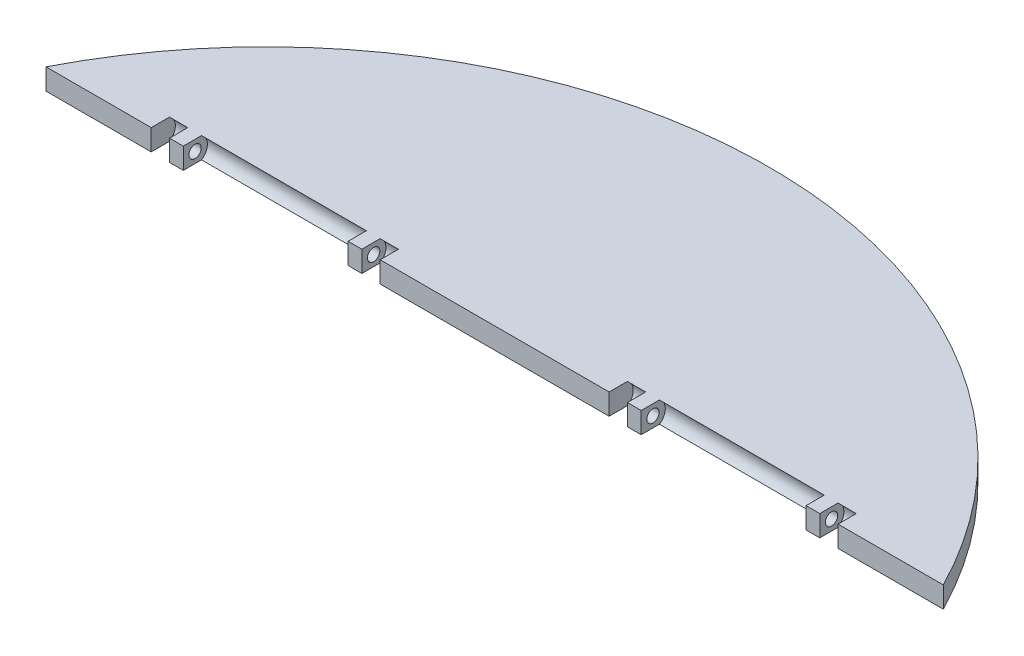
ISO-10303-21;
HEADER;
FILE_DESCRIPTION(('STEP AP214'),'2;1');
FILE_NAME('part.step','',(''),(''),'','','');
FILE_SCHEMA(('AUTOMOTIVE_DESIGN { 1 0 10303 214 1 1 1 1 }'));
ENDSEC;
DATA;
#1=APPLICATION_CONTEXT('core data for automotive mechanical design processes');
#2=APPLICATION_PROTOCOL_DEFINITION('international standard','automotive_design',2000,#1);
#3=PRODUCT_CONTEXT('',#1,'mechanical');
#4=PRODUCT('Part','Part','',(#3));
#5=PRODUCT_RELATED_PRODUCT_CATEGORY('part','',(#4));
#6=PRODUCT_DEFINITION_FORMATION('','',#4);
#7=PRODUCT_DEFINITION_CONTEXT('part definition',#1,'design');
#8=PRODUCT_DEFINITION('design','',#6,#7);
#9=PRODUCT_DEFINITION_SHAPE('','',#8);
#10=(LENGTH_UNIT() NAMED_UNIT(*) SI_UNIT(.MILLI.,.METRE.));
#11=(NAMED_UNIT(*) PLANE_ANGLE_UNIT() SI_UNIT($,.RADIAN.));
#12=(NAMED_UNIT(*) SI_UNIT($,.STERADIAN.) SOLID_ANGLE_UNIT());
#13=UNCERTAINTY_MEASURE_WITH_UNIT(LENGTH_MEASURE(1.E-05),#10,'distance_accuracy_value','');
#14=(GEOMETRIC_REPRESENTATION_CONTEXT(3) GLOBAL_UNCERTAINTY_ASSIGNED_CONTEXT((#13)) GLOBAL_UNIT_ASSIGNED_CONTEXT((#10,
#11,#12)) REPRESENTATION_CONTEXT('',''));
#15=CARTESIAN_POINT('',(0.,0.,0.));
#16=DIRECTION('',(0.,0.,1.));
#17=DIRECTION('',(1.,0.,0.));
#18=AXIS2_PLACEMENT_3D('',#15,#16,#17);
#19=CARTESIAN_POINT('',(-12.5,1.15,-26.2848125951927));
#20=DIRECTION('',(-1.,0.,0.));
#21=DIRECTION('',(0.,0.,1.));
#22=AXIS2_PLACEMENT_3D('',#19,#20,#21);
#23=CYLINDRICAL_SURFACE('',#22,1.35);
#24=DIRECTION('',(-1.,0.,0.));
#25=VECTOR('',#24,1.);
#26=CARTESIAN_POINT('',(-12.5,2.3,-26.9919193763793));
#27=LINE('',#26,#25);
#28=CARTESIAN_POINT('',(-12.5,2.3,-26.9919193763793));
#29=VERTEX_POINT('',#28);
#30=CARTESIAN_POINT('',(-14.5,2.3,-26.9919193763793));
#31=VERTEX_POINT('',#30);
#32=EDGE_CURVE('E372',#29,#31,#27,.T.);
#33=ORIENTED_EDGE('',*,*,#32,.T.);
#34=CARTESIAN_POINT('',(-14.5,1.15,-26.2848125951927));
#35=DIRECTION('',(1.,0.,0.));
#36=DIRECTION('',(0.,0.,-1.));
#37=AXIS2_PLACEMENT_3D('',#34,#35,#36);
#38=CIRCLE('',#37,1.35);
#39=CARTESIAN_POINT('',(-14.5,0.,-26.9919193763793));
#40=VERTEX_POINT('',#39);
#41=EDGE_CURVE('E285',#40,#31,#38,.T.);
#42=ORIENTED_EDGE('',*,*,#41,.F.);
#43=DIRECTION('',(-1.,0.,0.));
#44=VECTOR('',#43,1.);
#45=CARTESIAN_POINT('',(-12.5,0.,-26.9919193763793));
#46=LINE('',#45,#44);
#47=CARTESIAN_POINT('',(-12.5,0.,-26.9919193763793));
#48=VERTEX_POINT('',#47);
#49=EDGE_CURVE('E366',#48,#40,#46,.T.);
#50=ORIENTED_EDGE('',*,*,#49,.F.);
#51=CARTESIAN_POINT('',(-12.5,1.15,-26.2848125951927));
#52=DIRECTION('',(1.,0.,0.));
#53=DIRECTION('',(0.,0.,-1.));
#54=AXIS2_PLACEMENT_3D('',#51,#52,#53);
#55=CIRCLE('',#54,1.35);
#56=EDGE_CURVE('E354',#48,#29,#55,.T.);
#57=ORIENTED_EDGE('',*,*,#56,.T.);
#58=EDGE_LOOP('',(#33,#42,#50,#57));
#59=FACE_BOUND('',#58,.T.);
#60=ADVANCED_FACE('F41',(#59),#23,.F.);
#61=CARTESIAN_POINT('',(-16.,1.15,-26.2848125951927));
#62=DIRECTION('',(1.,0.,0.));
#63=DIRECTION('',(0.,0.,-1.));
#64=AXIS2_PLACEMENT_3D('',#61,#62,#63);
#65=CIRCLE('',#64,1.35);
#66=CARTESIAN_POINT('',(-16.,0.,-26.9919193763793));
#67=VERTEX_POINT('',#66);
#68=CARTESIAN_POINT('',(-16.,2.3,-26.9919193763793));
#69=VERTEX_POINT('',#68);
#70=EDGE_CURVE('E293',#67,#69,#65,.T.);
#71=ORIENTED_EDGE('',*,*,#70,.T.);
#72=CARTESIAN_POINT('',(-34.,2.3,-26.9919193763793));
#73=VERTEX_POINT('',#72);
#74=EDGE_CURVE('E375',#69,#73,#27,.T.);
#75=ORIENTED_EDGE('',*,*,#74,.T.);
#76=CARTESIAN_POINT('',(-34.,1.15,-26.2848125951927));
#77=DIRECTION('',(1.,0.,0.));
#78=DIRECTION('',(0.,0.,-1.));
#79=AXIS2_PLACEMENT_3D('',#76,#77,#78);
#80=CIRCLE('',#79,1.35);
#81=CARTESIAN_POINT('',(-34.,0.,-26.9919193763793));
#82=VERTEX_POINT('',#81);
#83=EDGE_CURVE('E316',#82,#73,#80,.T.);
#84=ORIENTED_EDGE('',*,*,#83,.F.);
#85=EDGE_CURVE('E370',#67,#82,#46,.T.);
#86=ORIENTED_EDGE('',*,*,#85,.F.);
#87=EDGE_LOOP('',(#71,#75,#84,#86));
#88=FACE_BOUND('',#87,.T.);
#89=ADVANCED_FACE('F553',(#88),#23,.F.);
#90=CARTESIAN_POINT('',(0.,2.3,-25.));
#91=DIRECTION('',(0.,0.,-1.));
#92=DIRECTION('',(-1.,0.,0.));
#93=AXIS2_PLACEMENT_3D('',#90,#91,#92);
#94=PLANE('',#93);
#95=DIRECTION('',(0.,-1.,0.));
#96=VECTOR('',#95,1.);
#97=CARTESIAN_POINT('',(-12.5,0.,-25.));
#98=LINE('',#97,#96);
#99=CARTESIAN_POINT('',(-12.5,2.3,-25.));
#100=VERTEX_POINT('',#99);
#101=CARTESIAN_POINT('',(-12.5,0.,-25.));
#102=VERTEX_POINT('',#101);
#103=EDGE_CURVE('E347',#100,#102,#98,.T.);
#104=ORIENTED_EDGE('',*,*,#103,.T.);
#105=DIRECTION('',(1.,0.,0.));
#106=VECTOR('',#105,1.);
#107=CARTESIAN_POINT('',(0.,0.,-25.));
#108=LINE('',#107,#106);
#109=CARTESIAN_POINT('',(12.5,0.,-25.));
#110=VERTEX_POINT('',#109);
#111=EDGE_CURVE('E485',#102,#110,#108,.T.);
#112=ORIENTED_EDGE('',*,*,#111,.T.);
#113=DIRECTION('',(0.,-1.,0.));
#114=VECTOR('',#113,1.);
#115=CARTESIAN_POINT('',(12.5,0.,-25.));
#116=LINE('',#115,#114);
#117=CARTESIAN_POINT('',(12.5,2.3,-25.));
#118=VERTEX_POINT('',#117);
#119=EDGE_CURVE('E451',#118,#110,#116,.T.);
#120=ORIENTED_EDGE('',*,*,#119,.F.);
#121=DIRECTION('',(1.,0.,0.));
#122=VECTOR('',#121,1.);
#123=CARTESIAN_POINT('',(0.,2.3,-25.));
#124=LINE('',#123,#122);
#125=EDGE_CURVE('E478',#100,#118,#124,.T.);
#126=ORIENTED_EDGE('',*,*,#125,.F.);
#127=EDGE_LOOP('',(#104,#112,#120,#126));
#128=FACE_BOUND('',#127,.T.);
#129=ADVANCED_FACE('F516',(#128),#94,.F.);
#130=CARTESIAN_POINT('',(0.,2.3,0.));
#131=DIRECTION('',(0.,1.,0.));
#132=DIRECTION('',(0.,0.,1.));
#133=AXIS2_PLACEMENT_3D('',#130,#131,#132);
#134=PLANE('',#133);
#135=ORIENTED_EDGE('',*,*,#32,.F.);
#136=DIRECTION('',(0.,0.,-1.));
#137=VECTOR('',#136,1.);
#138=CARTESIAN_POINT('',(-12.5,2.3,0.));
#139=LINE('',#138,#137);
#140=EDGE_CURVE('E351',#100,#29,#139,.T.);
#141=ORIENTED_EDGE('',*,*,#140,.F.);
#142=ORIENTED_EDGE('',*,*,#125,.T.);
#143=DIRECTION('',(0.,0.,-1.));
#144=VECTOR('',#143,1.);
#145=CARTESIAN_POINT('',(12.5,2.3,0.));
#146=LINE('',#145,#144);
#147=CARTESIAN_POINT('',(12.5,2.3,-26.9919193763793));
#148=VERTEX_POINT('',#147);
#149=EDGE_CURVE('E448',#118,#148,#146,.T.);
#150=ORIENTED_EDGE('',*,*,#149,.T.);
#151=DIRECTION('',(1.,0.,0.));
#152=VECTOR('',#151,1.);
#153=CARTESIAN_POINT('',(12.5,2.3,-26.9919193763793));
#154=LINE('',#153,#152);
#155=CARTESIAN_POINT('',(14.5,2.3,-26.9919193763793));
#156=VERTEX_POINT('',#155);
#157=EDGE_CURVE('E465',#148,#156,#154,.T.);
#158=ORIENTED_EDGE('',*,*,#157,.T.);
#159=DIRECTION('',(0.,0.,-1.));
#160=VECTOR('',#159,1.);
#161=CARTESIAN_POINT('',(14.5,2.3,0.));
#162=LINE('',#161,#160);
#163=CARTESIAN_POINT('',(14.5,2.3,-25.));
#164=VERTEX_POINT('',#163);
#165=EDGE_CURVE('E399',#164,#156,#162,.T.);
#166=ORIENTED_EDGE('',*,*,#165,.F.);
#167=DIRECTION('',(-1.,0.,0.));
#168=VECTOR('',#167,1.);
#169=CARTESIAN_POINT('',(16.,2.3,-25.));
#170=LINE('',#169,#168);
#171=CARTESIAN_POINT('',(16.,2.3,-25.));
#172=VERTEX_POINT('',#171);
#173=EDGE_CURVE('E405',#172,#164,#170,.T.);
#174=ORIENTED_EDGE('',*,*,#173,.F.);
#175=DIRECTION('',(0.,0.,-1.));
#176=VECTOR('',#175,1.);
#177=CARTESIAN_POINT('',(16.,2.3,0.));
#178=LINE('',#177,#176);
#179=CARTESIAN_POINT('',(16.,2.3,-26.9919193763793));
#180=VERTEX_POINT('',#179);
#181=EDGE_CURVE('E386',#172,#180,#178,.T.);
#182=ORIENTED_EDGE('',*,*,#181,.T.);
#183=CARTESIAN_POINT('',(34.,2.3,-26.9919193763793));
#184=VERTEX_POINT('',#183);
#185=EDGE_CURVE('E469',#180,#184,#154,.T.);
#186=ORIENTED_EDGE('',*,*,#185,.T.);
#187=DIRECTION('',(0.,0.,-1.));
#188=VECTOR('',#187,1.);
#189=CARTESIAN_POINT('',(34.,2.3,0.));
#190=LINE('',#189,#188);
#191=CARTESIAN_POINT('',(34.,2.3,-25.));
#192=VERTEX_POINT('',#191);
#193=EDGE_CURVE('E432',#192,#184,#190,.T.);
#194=ORIENTED_EDGE('',*,*,#193,.F.);
#195=DIRECTION('',(-1.,0.,0.));
#196=VECTOR('',#195,1.);
#197=CARTESIAN_POINT('',(35.5,2.3,-25.));
#198=LINE('',#197,#196);
#199=CARTESIAN_POINT('',(35.5,2.3,-25.));
#200=VERTEX_POINT('',#199);
#201=EDGE_CURVE('E438',#200,#192,#198,.T.);
#202=ORIENTED_EDGE('',*,*,#201,.F.);
#203=DIRECTION('',(0.,0.,-1.));
#204=VECTOR('',#203,1.);
#205=CARTESIAN_POINT('',(35.5,2.3,0.));
#206=LINE('',#205,#204);
#207=CARTESIAN_POINT('',(35.5,2.3,-26.9919193763793));
#208=VERTEX_POINT('',#207);
#209=EDGE_CURVE('E418',#200,#208,#206,.T.);
#210=ORIENTED_EDGE('',*,*,#209,.T.);
#211=CARTESIAN_POINT('',(37.5,2.3,-26.9919193763793));
#212=VERTEX_POINT('',#211);
#213=EDGE_CURVE('E470',#208,#212,#154,.T.);
#214=ORIENTED_EDGE('',*,*,#213,.T.);
#215=DIRECTION('',(0.,0.,-1.));
#216=VECTOR('',#215,1.);
#217=CARTESIAN_POINT('',(37.5,2.3,0.));
#218=LINE('',#217,#216);
#219=CARTESIAN_POINT('',(37.5,2.3,-25.));
#220=VERTEX_POINT('',#219);
#221=EDGE_CURVE('E460',#220,#212,#218,.T.);
#222=ORIENTED_EDGE('',*,*,#221,.F.);
#223=CARTESIAN_POINT('',(48.9897948556636,2.3,-25.));
#224=VERTEX_POINT('',#223);
#225=EDGE_CURVE('E479',#220,#224,#124,.T.);
#226=ORIENTED_EDGE('',*,*,#225,.T.);
#227=CARTESIAN_POINT('',(0.,2.3,0.));
#228=DIRECTION('',(0.,1.,0.));
#229=DIRECTION('',(0.,0.,1.));
#230=AXIS2_PLACEMENT_3D('',#227,#228,#229);
#231=CIRCLE('',#230,55.);
#232=CARTESIAN_POINT('',(-48.9897948556636,2.3,-25.));
#233=VERTEX_POINT('',#232);
#234=EDGE_CURVE('E477',#224,#233,#231,.T.);
#235=ORIENTED_EDGE('',*,*,#234,.T.);
#236=CARTESIAN_POINT('',(-37.5,2.3,-25.));
#237=VERTEX_POINT('',#236);
#238=EDGE_CURVE('E474',#233,#237,#124,.T.);
#239=ORIENTED_EDGE('',*,*,#238,.T.);
#240=DIRECTION('',(0.,0.,-1.));
#241=VECTOR('',#240,1.);
#242=CARTESIAN_POINT('',(-37.5,2.3,0.));
#243=LINE('',#242,#241);
#244=CARTESIAN_POINT('',(-37.5,2.3,-26.9919193763793));
#245=VERTEX_POINT('',#244);
#246=EDGE_CURVE('E361',#237,#245,#243,.T.);
#247=ORIENTED_EDGE('',*,*,#246,.T.);
#248=CARTESIAN_POINT('',(-35.5,2.3,-26.9919193763793));
#249=VERTEX_POINT('',#248);
#250=EDGE_CURVE('E356',#249,#245,#27,.T.);
#251=ORIENTED_EDGE('',*,*,#250,.F.);
#252=DIRECTION('',(0.,0.,-1.));
#253=VECTOR('',#252,1.);
#254=CARTESIAN_POINT('',(-35.5,2.3,0.));
#255=LINE('',#254,#253);
#256=CARTESIAN_POINT('',(-35.5,2.3,-25.));
#257=VERTEX_POINT('',#256);
#258=EDGE_CURVE('E321',#257,#249,#255,.T.);
#259=ORIENTED_EDGE('',*,*,#258,.F.);
#260=DIRECTION('',(1.,0.,0.));
#261=VECTOR('',#260,1.);
#262=CARTESIAN_POINT('',(-35.5,2.3,-25.));
#263=LINE('',#262,#261);
#264=CARTESIAN_POINT('',(-34.,2.3,-25.));
#265=VERTEX_POINT('',#264);
#266=EDGE_CURVE('E326',#257,#265,#263,.T.);
#267=ORIENTED_EDGE('',*,*,#266,.T.);
#268=DIRECTION('',(0.,0.,-1.));
#269=VECTOR('',#268,1.);
#270=CARTESIAN_POINT('',(-34.,2.3,0.));
#271=LINE('',#270,#269);
#272=EDGE_CURVE('E335',#265,#73,#271,.T.);
#273=ORIENTED_EDGE('',*,*,#272,.T.);
#274=ORIENTED_EDGE('',*,*,#74,.F.);
#275=DIRECTION('',(0.,0.,-1.));
#276=VECTOR('',#275,1.);
#277=CARTESIAN_POINT('',(-16.,2.3,0.));
#278=LINE('',#277,#276);
#279=CARTESIAN_POINT('',(-16.,2.3,-25.));
#280=VERTEX_POINT('',#279);
#281=EDGE_CURVE('E291',#280,#69,#278,.T.);
#282=ORIENTED_EDGE('',*,*,#281,.F.);
#283=DIRECTION('',(1.,0.,0.));
#284=VECTOR('',#283,1.);
#285=CARTESIAN_POINT('',(-16.,2.3,-25.));
#286=LINE('',#285,#284);
#287=CARTESIAN_POINT('',(-14.5,2.3,-25.));
#288=VERTEX_POINT('',#287);
#289=EDGE_CURVE('E296',#280,#288,#286,.T.);
#290=ORIENTED_EDGE('',*,*,#289,.T.);
#291=DIRECTION('',(0.,0.,-1.));
#292=VECTOR('',#291,1.);
#293=CARTESIAN_POINT('',(-14.5,2.3,0.));
#294=LINE('',#293,#292);
#295=EDGE_CURVE('E304',#288,#31,#294,.T.);
#296=ORIENTED_EDGE('',*,*,#295,.T.);
#297=EDGE_LOOP('',(#135,#141,#142,#150,#158,#166,#174,#182,#186,#194,#202,#210,#214,#222,#226,
#235,#239,#247,#251,#259,#267,#273,#274,#282,#290,#296));
#298=FACE_BOUND('',#297,.T.);
#299=ADVANCED_FACE('F506',(#298),#134,.T.);
#300=CARTESIAN_POINT('',(0.,0.,0.));
#301=DIRECTION('',(0.,1.,0.));
#302=DIRECTION('',(0.,0.,1.));
#303=AXIS2_PLACEMENT_3D('',#300,#301,#302);
#304=PLANE('',#303);
#305=DIRECTION('',(-1.,0.,0.));
#306=VECTOR('',#305,1.);
#307=CARTESIAN_POINT('',(11.5,0.,-38.875));
#308=LINE('',#307,#306);
#309=CARTESIAN_POINT('',(11.5,0.,-38.875));
#310=VERTEX_POINT('',#309);
#311=CARTESIAN_POINT('',(9.5,0.,-38.875));
#312=VERTEX_POINT('',#311);
#313=EDGE_CURVE('E56',#310,#312,#308,.T.);
#314=ORIENTED_EDGE('',*,*,#313,.F.);
#315=DIRECTION('',(0.,0.,-1.));
#316=VECTOR('',#315,1.);
#317=CARTESIAN_POINT('',(11.5,0.,0.));
#318=LINE('',#317,#316);
#319=CARTESIAN_POINT('',(11.5,0.,-41.125));
#320=VERTEX_POINT('',#319);
#321=EDGE_CURVE('E61',#310,#320,#318,.T.);
#322=ORIENTED_EDGE('',*,*,#321,.T.);
#323=DIRECTION('',(-1.,0.,0.));
#324=VECTOR('',#323,1.);
#325=CARTESIAN_POINT('',(11.5,0.,-41.125));
#326=LINE('',#325,#324);
#327=CARTESIAN_POINT('',(9.5,0.,-41.125));
#328=VERTEX_POINT('',#327);
#329=EDGE_CURVE('E278',#320,#328,#326,.T.);
#330=ORIENTED_EDGE('',*,*,#329,.T.);
#331=DIRECTION('',(0.,0.,-1.));
#332=VECTOR('',#331,1.);
#333=CARTESIAN_POINT('',(9.5,0.,0.));
#334=LINE('',#333,#332);
#335=EDGE_CURVE('E261',#312,#328,#334,.T.);
#336=ORIENTED_EDGE('',*,*,#335,.F.);
#337=EDGE_LOOP('',(#314,#322,#330,#336));
#338=FACE_BOUND('',#337,.T.);
#339=DIRECTION('',(0.,0.,-1.));
#340=VECTOR('',#339,1.);
#341=CARTESIAN_POINT('',(-12.5,0.,0.));
#342=LINE('',#341,#340);
#343=EDGE_CURVE('E344',#102,#48,#342,.T.);
#344=ORIENTED_EDGE('',*,*,#343,.T.);
#345=ORIENTED_EDGE('',*,*,#49,.T.);
#346=DIRECTION('',(0.,0.,-1.));
#347=VECTOR('',#346,1.);
#348=CARTESIAN_POINT('',(-14.5,0.,0.));
#349=LINE('',#348,#347);
#350=CARTESIAN_POINT('',(-14.5,0.,-25.));
#351=VERTEX_POINT('',#350);
#352=EDGE_CURVE('E299',#351,#40,#349,.T.);
#353=ORIENTED_EDGE('',*,*,#352,.F.);
#354=DIRECTION('',(1.,0.,0.));
#355=VECTOR('',#354,1.);
#356=CARTESIAN_POINT('',(-16.,0.,-25.));
#357=LINE('',#356,#355);
#358=CARTESIAN_POINT('',(-16.,0.,-25.));
#359=VERTEX_POINT('',#358);
#360=EDGE_CURVE('E309',#359,#351,#357,.T.);
#361=ORIENTED_EDGE('',*,*,#360,.F.);
#362=DIRECTION('',(0.,0.,-1.));
#363=VECTOR('',#362,1.);
#364=CARTESIAN_POINT('',(-16.,0.,0.));
#365=LINE('',#364,#363);
#366=EDGE_CURVE('E284',#359,#67,#365,.T.);
#367=ORIENTED_EDGE('',*,*,#366,.T.);
#368=ORIENTED_EDGE('',*,*,#85,.T.);
#369=DIRECTION('',(0.,0.,-1.));
#370=VECTOR('',#369,1.);
#371=CARTESIAN_POINT('',(-34.,0.,0.));
#372=LINE('',#371,#370);
#373=CARTESIAN_POINT('',(-34.,0.,-25.));
#374=VERTEX_POINT('',#373);
#375=EDGE_CURVE('E329',#374,#82,#372,.T.);
#376=ORIENTED_EDGE('',*,*,#375,.F.);
#377=DIRECTION('',(1.,0.,0.));
#378=VECTOR('',#377,1.);
#379=CARTESIAN_POINT('',(-35.5,0.,-25.));
#380=LINE('',#379,#378);
#381=CARTESIAN_POINT('',(-35.5,0.,-25.));
#382=VERTEX_POINT('',#381);
#383=EDGE_CURVE('E341',#382,#374,#380,.T.);
#384=ORIENTED_EDGE('',*,*,#383,.F.);
#385=DIRECTION('',(0.,0.,-1.));
#386=VECTOR('',#385,1.);
#387=CARTESIAN_POINT('',(-35.5,0.,0.));
#388=LINE('',#387,#386);
#389=CARTESIAN_POINT('',(-35.5,0.,-26.9919193763793));
#390=VERTEX_POINT('',#389);
#391=EDGE_CURVE('E315',#382,#390,#388,.T.);
#392=ORIENTED_EDGE('',*,*,#391,.T.);
#393=CARTESIAN_POINT('',(-37.5,0.,-26.9919193763793));
#394=VERTEX_POINT('',#393);
#395=EDGE_CURVE('E371',#390,#394,#46,.T.);
#396=ORIENTED_EDGE('',*,*,#395,.T.);
#397=DIRECTION('',(0.,0.,-1.));
#398=VECTOR('',#397,1.);
#399=CARTESIAN_POINT('',(-37.5,0.,0.));
#400=LINE('',#399,#398);
#401=CARTESIAN_POINT('',(-37.5,0.,-25.));
#402=VERTEX_POINT('',#401);
#403=EDGE_CURVE('E343',#402,#394,#400,.T.);
#404=ORIENTED_EDGE('',*,*,#403,.F.);
#405=CARTESIAN_POINT('',(-48.9897948556636,0.,-25.));
#406=VERTEX_POINT('',#405);
#407=EDGE_CURVE('E481',#406,#402,#108,.T.);
#408=ORIENTED_EDGE('',*,*,#407,.F.);
#409=CARTESIAN_POINT('',(0.,0.,0.));
#410=DIRECTION('',(0.,1.,0.));
#411=DIRECTION('',(0.,0.,1.));
#412=AXIS2_PLACEMENT_3D('',#409,#410,#411);
#413=CIRCLE('',#412,55.);
#414=CARTESIAN_POINT('',(48.9897948556636,0.,-25.));
#415=VERTEX_POINT('',#414);
#416=EDGE_CURVE('E484',#415,#406,#413,.T.);
#417=ORIENTED_EDGE('',*,*,#416,.F.);
#418=CARTESIAN_POINT('',(37.5,0.,-25.));
#419=VERTEX_POINT('',#418);
#420=EDGE_CURVE('E468',#419,#415,#108,.T.);
#421=ORIENTED_EDGE('',*,*,#420,.F.);
#422=DIRECTION('',(0.,0.,-1.));
#423=VECTOR('',#422,1.);
#424=CARTESIAN_POINT('',(37.5,0.,0.));
#425=LINE('',#424,#423);
#426=CARTESIAN_POINT('',(37.5,0.,-26.9919193763793));
#427=VERTEX_POINT('',#426);
#428=EDGE_CURVE('E440',#419,#427,#425,.T.);
#429=ORIENTED_EDGE('',*,*,#428,.T.);
#430=DIRECTION('',(1.,0.,0.));
#431=VECTOR('',#430,1.);
#432=CARTESIAN_POINT('',(12.5,0.,-26.9919193763793));
#433=LINE('',#432,#431);
#434=CARTESIAN_POINT('',(35.5,0.,-26.9919193763793));
#435=VERTEX_POINT('',#434);
#436=EDGE_CURVE('E454',#435,#427,#433,.T.);
#437=ORIENTED_EDGE('',*,*,#436,.F.);
#438=DIRECTION('',(0.,0.,-1.));
#439=VECTOR('',#438,1.);
#440=CARTESIAN_POINT('',(35.5,0.,0.));
#441=LINE('',#440,#439);
#442=CARTESIAN_POINT('',(35.5,0.,-25.));
#443=VERTEX_POINT('',#442);
#444=EDGE_CURVE('E411',#443,#435,#441,.T.);
#445=ORIENTED_EDGE('',*,*,#444,.F.);
#446=DIRECTION('',(-1.,0.,0.));
#447=VECTOR('',#446,1.);
#448=CARTESIAN_POINT('',(35.5,0.,-25.));
#449=LINE('',#448,#447);
#450=CARTESIAN_POINT('',(34.,0.,-25.));
#451=VERTEX_POINT('',#450);
#452=EDGE_CURVE('E423',#443,#451,#449,.T.);
#453=ORIENTED_EDGE('',*,*,#452,.T.);
#454=DIRECTION('',(0.,0.,-1.));
#455=VECTOR('',#454,1.);
#456=CARTESIAN_POINT('',(34.,0.,0.));
#457=LINE('',#456,#455);
#458=CARTESIAN_POINT('',(34.,0.,-26.9919193763793));
#459=VERTEX_POINT('',#458);
#460=EDGE_CURVE('E426',#451,#459,#457,.T.);
#461=ORIENTED_EDGE('',*,*,#460,.T.);
#462=CARTESIAN_POINT('',(16.,0.,-26.9919193763793));
#463=VERTEX_POINT('',#462);
#464=EDGE_CURVE('E473',#463,#459,#433,.T.);
#465=ORIENTED_EDGE('',*,*,#464,.F.);
#466=DIRECTION('',(0.,0.,-1.));
#467=VECTOR('',#466,1.);
#468=CARTESIAN_POINT('',(16.,0.,0.));
#469=LINE('',#468,#467);
#470=CARTESIAN_POINT('',(16.,0.,-25.));
#471=VERTEX_POINT('',#470);
#472=EDGE_CURVE('E379',#471,#463,#469,.T.);
#473=ORIENTED_EDGE('',*,*,#472,.F.);
#474=DIRECTION('',(-1.,0.,0.));
#475=VECTOR('',#474,1.);
#476=CARTESIAN_POINT('',(16.,0.,-25.));
#477=LINE('',#476,#475);
#478=CARTESIAN_POINT('',(14.5,0.,-25.));
#479=VERTEX_POINT('',#478);
#480=EDGE_CURVE('E391',#471,#479,#477,.T.);
#481=ORIENTED_EDGE('',*,*,#480,.T.);
#482=DIRECTION('',(0.,0.,-1.));
#483=VECTOR('',#482,1.);
#484=CARTESIAN_POINT('',(14.5,0.,0.));
#485=LINE('',#484,#483);
#486=CARTESIAN_POINT('',(14.5,0.,-26.9919193763793));
#487=VERTEX_POINT('',#486);
#488=EDGE_CURVE('E394',#479,#487,#485,.T.);
#489=ORIENTED_EDGE('',*,*,#488,.T.);
#490=CARTESIAN_POINT('',(12.5,0.,-26.9919193763793));
#491=VERTEX_POINT('',#490);
#492=EDGE_CURVE('E471',#491,#487,#433,.T.);
#493=ORIENTED_EDGE('',*,*,#492,.F.);
#494=DIRECTION('',(0.,0.,-1.));
#495=VECTOR('',#494,1.);
#496=CARTESIAN_POINT('',(12.5,0.,0.));
#497=LINE('',#496,#495);
#498=EDGE_CURVE('E441',#110,#491,#497,.T.);
#499=ORIENTED_EDGE('',*,*,#498,.F.);
#500=ORIENTED_EDGE('',*,*,#111,.F.);
#501=EDGE_LOOP('',(#344,#345,#353,#361,#367,#368,#376,#384,#392,#396,#404,#408,#417,#421,#429,
#437,#445,#453,#461,#465,#473,#481,#489,#493,#499,#500));
#502=FACE_BOUND('',#501,.T.);
#503=ADVANCED_FACE('F498',(#338,#502),#304,.F.);
#504=CARTESIAN_POINT('',(12.5,1.15,-26.2848125951927));
#505=DIRECTION('',(1.,0.,0.));
#506=DIRECTION('',(0.,0.,-1.));
#507=AXIS2_PLACEMENT_3D('',#504,#505,#506);
#508=CYLINDRICAL_SURFACE('',#507,1.35);
#509=CARTESIAN_POINT('',(14.5,1.15,-26.2848125951927));
#510=DIRECTION('',(1.,0.,0.));
#511=DIRECTION('',(0.,0.,-1.));
#512=AXIS2_PLACEMENT_3D('',#509,#510,#511);
#513=CIRCLE('',#512,1.35);
#514=EDGE_CURVE('E397',#487,#156,#513,.T.);
#515=ORIENTED_EDGE('',*,*,#514,.T.);
#516=ORIENTED_EDGE('',*,*,#157,.F.);
#517=CARTESIAN_POINT('',(12.5,1.15,-26.2848125951927));
#518=DIRECTION('',(1.,0.,0.));
#519=DIRECTION('',(0.,0.,-1.));
#520=AXIS2_PLACEMENT_3D('',#517,#518,#519);
#521=CIRCLE('',#520,1.35);
#522=EDGE_CURVE('E444',#491,#148,#521,.T.);
#523=ORIENTED_EDGE('',*,*,#522,.F.);
#524=ORIENTED_EDGE('',*,*,#492,.T.);
#525=EDGE_LOOP('',(#515,#516,#523,#524));
#526=FACE_BOUND('',#525,.T.);
#527=ADVANCED_FACE('F526',(#526),#508,.F.);
#528=ORIENTED_EDGE('',*,*,#185,.F.);
#529=CARTESIAN_POINT('',(16.,1.15,-26.2848125951927));
#530=DIRECTION('',(1.,0.,0.));
#531=DIRECTION('',(0.,0.,-1.));
#532=AXIS2_PLACEMENT_3D('',#529,#530,#531);
#533=CIRCLE('',#532,1.35);
#534=EDGE_CURVE('E383',#463,#180,#533,.T.);
#535=ORIENTED_EDGE('',*,*,#534,.F.);
#536=ORIENTED_EDGE('',*,*,#464,.T.);
#537=CARTESIAN_POINT('',(34.,1.15,-26.2848125951927));
#538=DIRECTION('',(1.,0.,0.));
#539=DIRECTION('',(0.,0.,-1.));
#540=AXIS2_PLACEMENT_3D('',#537,#538,#539);
#541=CIRCLE('',#540,1.35);
#542=EDGE_CURVE('E429',#459,#184,#541,.T.);
#543=ORIENTED_EDGE('',*,*,#542,.T.);
#544=EDGE_LOOP('',(#528,#535,#536,#543));
#545=FACE_BOUND('',#544,.T.);
#546=ADVANCED_FACE('F639',(#545),#508,.F.);
#547=ORIENTED_EDGE('',*,*,#407,.T.);
#548=DIRECTION('',(0.,-1.,0.));
#549=VECTOR('',#548,1.);
#550=CARTESIAN_POINT('',(-37.5,0.,-25.));
#551=LINE('',#550,#549);
#552=EDGE_CURVE('E359',#237,#402,#551,.T.);
#553=ORIENTED_EDGE('',*,*,#552,.F.);
#554=ORIENTED_EDGE('',*,*,#238,.F.);
#555=DIRECTION('',(0.,-1.,0.));
#556=VECTOR('',#555,1.);
#557=CARTESIAN_POINT('',(-48.9897948556636,2.3,-25.));
#558=LINE('',#557,#556);
#559=EDGE_CURVE('E49',#233,#406,#558,.T.);
#560=ORIENTED_EDGE('',*,*,#559,.T.);
#561=EDGE_LOOP('',(#547,#553,#554,#560));
#562=FACE_BOUND('',#561,.T.);
#563=ADVANCED_FACE('F491',(#562),#94,.F.);
#564=ORIENTED_EDGE('',*,*,#225,.F.);
#565=DIRECTION('',(0.,-1.,0.));
#566=VECTOR('',#565,1.);
#567=CARTESIAN_POINT('',(37.5,0.,-25.));
#568=LINE('',#567,#566);
#569=EDGE_CURVE('E445',#220,#419,#568,.T.);
#570=ORIENTED_EDGE('',*,*,#569,.T.);
#571=ORIENTED_EDGE('',*,*,#420,.T.);
#572=DIRECTION('',(0.,-1.,0.));
#573=VECTOR('',#572,1.);
#574=CARTESIAN_POINT('',(48.9897948556636,2.3,-25.));
#575=LINE('',#574,#573);
#576=EDGE_CURVE('E11',#224,#415,#575,.T.);
#577=ORIENTED_EDGE('',*,*,#576,.F.);
#578=EDGE_LOOP('',(#564,#570,#571,#577));
#579=FACE_BOUND('',#578,.T.);
#580=ADVANCED_FACE('F43',(#579),#94,.F.);
#581=CARTESIAN_POINT('',(0.,2.3,0.));
#582=DIRECTION('',(0.,-1.,0.));
#583=DIRECTION('',(0.,0.,-1.));
#584=AXIS2_PLACEMENT_3D('',#581,#582,#583);
#585=CYLINDRICAL_SURFACE('',#584,55.);
#586=ORIENTED_EDGE('',*,*,#416,.T.);
#587=ORIENTED_EDGE('',*,*,#559,.F.);
#588=ORIENTED_EDGE('',*,*,#234,.F.);
#589=ORIENTED_EDGE('',*,*,#576,.T.);
#590=EDGE_LOOP('',(#586,#587,#588,#589));
#591=FACE_BOUND('',#590,.T.);
#592=ADVANCED_FACE('F511',(#591),#585,.T.);
#593=ORIENTED_EDGE('',*,*,#213,.F.);
#594=CARTESIAN_POINT('',(35.5,1.15,-26.2848125951927));
#595=DIRECTION('',(1.,0.,0.));
#596=DIRECTION('',(0.,0.,-1.));
#597=AXIS2_PLACEMENT_3D('',#594,#595,#596);
#598=CIRCLE('',#597,1.35);
#599=EDGE_CURVE('E415',#435,#208,#598,.T.);
#600=ORIENTED_EDGE('',*,*,#599,.F.);
#601=ORIENTED_EDGE('',*,*,#436,.T.);
#602=CARTESIAN_POINT('',(37.5,1.15,-26.2848125951927));
#603=DIRECTION('',(1.,0.,0.));
#604=DIRECTION('',(0.,0.,-1.));
#605=AXIS2_PLACEMENT_3D('',#602,#603,#604);
#606=CIRCLE('',#605,1.35);
#607=EDGE_CURVE('E457',#427,#212,#606,.T.);
#608=ORIENTED_EDGE('',*,*,#607,.T.);
#609=EDGE_LOOP('',(#593,#600,#601,#608));
#610=FACE_BOUND('',#609,.T.);
#611=ADVANCED_FACE('F632',(#610),#508,.F.);
#612=CARTESIAN_POINT('',(12.5,0.,0.));
#613=DIRECTION('',(1.,0.,0.));
#614=DIRECTION('',(0.,0.,-1.));
#615=AXIS2_PLACEMENT_3D('',#612,#613,#614);
#616=PLANE('',#615);
#617=ORIENTED_EDGE('',*,*,#498,.T.);
#618=ORIENTED_EDGE('',*,*,#522,.T.);
#619=ORIENTED_EDGE('',*,*,#149,.F.);
#620=ORIENTED_EDGE('',*,*,#119,.T.);
#621=EDGE_LOOP('',(#617,#618,#619,#620));
#622=FACE_BOUND('',#621,.T.);
#623=ADVANCED_FACE('F521',(#622),#616,.T.);
#624=CARTESIAN_POINT('',(37.5,0.,0.));
#625=DIRECTION('',(1.,0.,0.));
#626=DIRECTION('',(0.,0.,-1.));
#627=AXIS2_PLACEMENT_3D('',#624,#625,#626);
#628=PLANE('',#627);
#629=ORIENTED_EDGE('',*,*,#428,.F.);
#630=ORIENTED_EDGE('',*,*,#569,.F.);
#631=ORIENTED_EDGE('',*,*,#221,.T.);
#632=ORIENTED_EDGE('',*,*,#607,.F.);
#633=EDGE_LOOP('',(#629,#630,#631,#632));
#634=FACE_BOUND('',#633,.T.);
#635=ADVANCED_FACE('F628',(#634),#628,.F.);
#636=CARTESIAN_POINT('',(35.5,1.15,-26.2848125951927));
#637=DIRECTION('',(-1.,0.,0.));
#638=DIRECTION('',(0.,0.,1.));
#639=AXIS2_PLACEMENT_3D('',#636,#637,#638);
#640=CYLINDRICAL_SURFACE('',#639,0.674999999999999);
#641=CARTESIAN_POINT('',(35.5,1.15,-26.2848125951927));
#642=DIRECTION('',(1.,0.,0.));
#643=DIRECTION('',(0.,0.,-1.));
#644=AXIS2_PLACEMENT_3D('',#641,#642,#643);
#645=CIRCLE('',#644,0.674999999999999);
#646=CARTESIAN_POINT('',(35.5,1.15,-26.9598125951927));
#647=VERTEX_POINT('',#646);
#648=EDGE_CURVE('E408',#647,#647,#645,.T.);
#649=ORIENTED_EDGE('',*,*,#648,.T.);
#650=EDGE_LOOP('',(#649));
#651=FACE_BOUND('',#650,.T.);
#652=CARTESIAN_POINT('',(34.,1.15,-26.2848125951927));
#653=DIRECTION('',(1.,0.,0.));
#654=DIRECTION('',(0.,0.,-1.));
#655=AXIS2_PLACEMENT_3D('',#652,#653,#654);
#656=CIRCLE('',#655,0.674999999999999);
#657=CARTESIAN_POINT('',(34.,1.15,-26.9598125951927));
#658=VERTEX_POINT('',#657);
#659=EDGE_CURVE('E407',#658,#658,#656,.T.);
#660=ORIENTED_EDGE('',*,*,#659,.F.);
#661=EDGE_LOOP('',(#660));
#662=FACE_BOUND('',#661,.T.);
#663=ADVANCED_FACE('F624',(#651,#662),#640,.F.);
#664=CARTESIAN_POINT('',(35.5,0.,-25.));
#665=DIRECTION('',(0.,0.,-1.));
#666=DIRECTION('',(-1.,0.,0.));
#667=AXIS2_PLACEMENT_3D('',#664,#665,#666);
#668=PLANE('',#667);
#669=DIRECTION('',(0.,-1.,0.));
#670=VECTOR('',#669,1.);
#671=CARTESIAN_POINT('',(34.,0.,-25.));
#672=LINE('',#671,#670);
#673=EDGE_CURVE('E412',#192,#451,#672,.T.);
#674=ORIENTED_EDGE('',*,*,#673,.T.);
#675=ORIENTED_EDGE('',*,*,#452,.F.);
#676=DIRECTION('',(0.,-1.,0.));
#677=VECTOR('',#676,1.);
#678=CARTESIAN_POINT('',(35.5,0.,-25.));
#679=LINE('',#678,#677);
#680=EDGE_CURVE('E421',#200,#443,#679,.T.);
#681=ORIENTED_EDGE('',*,*,#680,.F.);
#682=ORIENTED_EDGE('',*,*,#201,.T.);
#683=EDGE_LOOP('',(#674,#675,#681,#682));
#684=FACE_BOUND('',#683,.T.);
#685=ADVANCED_FACE('F617',(#684),#668,.F.);
#686=CARTESIAN_POINT('',(35.5,0.,0.));
#687=DIRECTION('',(1.,0.,0.));
#688=DIRECTION('',(0.,0.,-1.));
#689=AXIS2_PLACEMENT_3D('',#686,#687,#688);
#690=PLANE('',#689);
#691=ORIENTED_EDGE('',*,*,#648,.F.);
#692=EDGE_LOOP('',(#691));
#693=FACE_BOUND('',#692,.T.);
#694=ORIENTED_EDGE('',*,*,#444,.T.);
#695=ORIENTED_EDGE('',*,*,#599,.T.);
#696=ORIENTED_EDGE('',*,*,#209,.F.);
#697=ORIENTED_EDGE('',*,*,#680,.T.);
#698=EDGE_LOOP('',(#694,#695,#696,#697));
#699=FACE_BOUND('',#698,.T.);
#700=ADVANCED_FACE('F614',(#693,#699),#690,.T.);
#701=CARTESIAN_POINT('',(34.,0.,0.));
#702=DIRECTION('',(1.,0.,0.));
#703=DIRECTION('',(0.,0.,-1.));
#704=AXIS2_PLACEMENT_3D('',#701,#702,#703);
#705=PLANE('',#704);
#706=ORIENTED_EDGE('',*,*,#659,.T.);
#707=EDGE_LOOP('',(#706));
#708=FACE_BOUND('',#707,.T.);
#709=ORIENTED_EDGE('',*,*,#460,.F.);
#710=ORIENTED_EDGE('',*,*,#673,.F.);
#711=ORIENTED_EDGE('',*,*,#193,.T.);
#712=ORIENTED_EDGE('',*,*,#542,.F.);
#713=EDGE_LOOP('',(#709,#710,#711,#712));
#714=FACE_BOUND('',#713,.T.);
#715=ADVANCED_FACE('F612',(#708,#714),#705,.F.);
#716=CARTESIAN_POINT('',(16.,1.15,-26.2848125951927));
#717=DIRECTION('',(-1.,0.,0.));
#718=DIRECTION('',(0.,0.,1.));
#719=AXIS2_PLACEMENT_3D('',#716,#717,#718);
#720=CYLINDRICAL_SURFACE('',#719,0.674999999999999);
#721=CARTESIAN_POINT('',(16.,1.15,-26.2848125951927));
#722=DIRECTION('',(1.,0.,0.));
#723=DIRECTION('',(0.,0.,-1.));
#724=AXIS2_PLACEMENT_3D('',#721,#722,#723);
#725=CIRCLE('',#724,0.674999999999999);
#726=CARTESIAN_POINT('',(16.,1.15,-26.9598125951927));
#727=VERTEX_POINT('',#726);
#728=EDGE_CURVE('E376',#727,#727,#725,.T.);
#729=ORIENTED_EDGE('',*,*,#728,.T.);
#730=EDGE_LOOP('',(#729));
#731=FACE_BOUND('',#730,.T.);
#732=CARTESIAN_POINT('',(14.5,1.15,-26.2848125951927));
#733=DIRECTION('',(1.,0.,0.));
#734=DIRECTION('',(0.,0.,-1.));
#735=AXIS2_PLACEMENT_3D('',#732,#733,#734);
#736=CIRCLE('',#735,0.674999999999999);
#737=CARTESIAN_POINT('',(14.5,1.15,-26.9598125951927));
#738=VERTEX_POINT('',#737);
#739=EDGE_CURVE('E369',#738,#738,#736,.T.);
#740=ORIENTED_EDGE('',*,*,#739,.F.);
#741=EDGE_LOOP('',(#740));
#742=FACE_BOUND('',#741,.T.);
#743=ADVANCED_FACE('F608',(#731,#742),#720,.F.);
#744=CARTESIAN_POINT('',(16.,0.,-25.));
#745=DIRECTION('',(0.,0.,-1.));
#746=DIRECTION('',(-1.,0.,0.));
#747=AXIS2_PLACEMENT_3D('',#744,#745,#746);
#748=PLANE('',#747);
#749=DIRECTION('',(0.,-1.,0.));
#750=VECTOR('',#749,1.);
#751=CARTESIAN_POINT('',(14.5,0.,-25.));
#752=LINE('',#751,#750);
#753=EDGE_CURVE('E380',#164,#479,#752,.T.);
#754=ORIENTED_EDGE('',*,*,#753,.T.);
#755=ORIENTED_EDGE('',*,*,#480,.F.);
#756=DIRECTION('',(0.,-1.,0.));
#757=VECTOR('',#756,1.);
#758=CARTESIAN_POINT('',(16.,0.,-25.));
#759=LINE('',#758,#757);
#760=EDGE_CURVE('E389',#172,#471,#759,.T.);
#761=ORIENTED_EDGE('',*,*,#760,.F.);
#762=ORIENTED_EDGE('',*,*,#173,.T.);
#763=EDGE_LOOP('',(#754,#755,#761,#762));
#764=FACE_BOUND('',#763,.T.);
#765=ADVANCED_FACE('F603',(#764),#748,.F.);
#766=CARTESIAN_POINT('',(16.,0.,0.));
#767=DIRECTION('',(1.,0.,0.));
#768=DIRECTION('',(0.,0.,-1.));
#769=AXIS2_PLACEMENT_3D('',#766,#767,#768);
#770=PLANE('',#769);
#771=ORIENTED_EDGE('',*,*,#728,.F.);
#772=EDGE_LOOP('',(#771));
#773=FACE_BOUND('',#772,.T.);
#774=ORIENTED_EDGE('',*,*,#472,.T.);
#775=ORIENTED_EDGE('',*,*,#534,.T.);
#776=ORIENTED_EDGE('',*,*,#181,.F.);
#777=ORIENTED_EDGE('',*,*,#760,.T.);
#778=EDGE_LOOP('',(#774,#775,#776,#777));
#779=FACE_BOUND('',#778,.T.);
#780=ADVANCED_FACE('F597',(#773,#779),#770,.T.);
#781=CARTESIAN_POINT('',(14.5,0.,0.));
#782=DIRECTION('',(1.,0.,0.));
#783=DIRECTION('',(0.,0.,-1.));
#784=AXIS2_PLACEMENT_3D('',#781,#782,#783);
#785=PLANE('',#784);
#786=ORIENTED_EDGE('',*,*,#739,.T.);
#787=EDGE_LOOP('',(#786));
#788=FACE_BOUND('',#787,.T.);
#789=ORIENTED_EDGE('',*,*,#488,.F.);
#790=ORIENTED_EDGE('',*,*,#753,.F.);
#791=ORIENTED_EDGE('',*,*,#165,.T.);
#792=ORIENTED_EDGE('',*,*,#514,.F.);
#793=EDGE_LOOP('',(#789,#790,#791,#792));
#794=FACE_BOUND('',#793,.T.);
#795=ADVANCED_FACE('F528',(#788,#794),#785,.F.);
#796=CARTESIAN_POINT('',(-35.5,1.15,-26.2848125951927));
#797=DIRECTION('',(1.,0.,0.));
#798=DIRECTION('',(0.,0.,-1.));
#799=AXIS2_PLACEMENT_3D('',#796,#797,#798);
#800=CIRCLE('',#799,1.35);
#801=EDGE_CURVE('E323',#390,#249,#800,.T.);
#802=ORIENTED_EDGE('',*,*,#801,.T.);
#803=ORIENTED_EDGE('',*,*,#250,.T.);
#804=CARTESIAN_POINT('',(-37.5,1.15,-26.2848125951927));
#805=DIRECTION('',(1.,0.,0.));
#806=DIRECTION('',(0.,0.,-1.));
#807=AXIS2_PLACEMENT_3D('',#804,#805,#806);
#808=CIRCLE('',#807,1.35);
#809=EDGE_CURVE('E348',#394,#245,#808,.T.);
#810=ORIENTED_EDGE('',*,*,#809,.F.);
#811=ORIENTED_EDGE('',*,*,#395,.F.);
#812=EDGE_LOOP('',(#802,#803,#810,#811));
#813=FACE_BOUND('',#812,.T.);
#814=ADVANCED_FACE('F557',(#813),#23,.F.);
#815=CARTESIAN_POINT('',(-12.5,0.,0.));
#816=DIRECTION('',(-1.,0.,0.));
#817=DIRECTION('',(0.,0.,-1.));
#818=AXIS2_PLACEMENT_3D('',#815,#816,#817);
#819=PLANE('',#818);
#820=ORIENTED_EDGE('',*,*,#343,.F.);
#821=ORIENTED_EDGE('',*,*,#103,.F.);
#822=ORIENTED_EDGE('',*,*,#140,.T.);
#823=ORIENTED_EDGE('',*,*,#56,.F.);
#824=EDGE_LOOP('',(#820,#821,#822,#823));
#825=FACE_BOUND('',#824,.T.);
#826=ADVANCED_FACE('F534',(#825),#819,.T.);
#827=CARTESIAN_POINT('',(-37.5,0.,0.));
#828=DIRECTION('',(-1.,0.,0.));
#829=DIRECTION('',(0.,0.,-1.));
#830=AXIS2_PLACEMENT_3D('',#827,#828,#829);
#831=PLANE('',#830);
#832=ORIENTED_EDGE('',*,*,#403,.T.);
#833=ORIENTED_EDGE('',*,*,#809,.T.);
#834=ORIENTED_EDGE('',*,*,#246,.F.);
#835=ORIENTED_EDGE('',*,*,#552,.T.);
#836=EDGE_LOOP('',(#832,#833,#834,#835));
#837=FACE_BOUND('',#836,.T.);
#838=ADVANCED_FACE('F503',(#837),#831,.F.);
#839=CARTESIAN_POINT('',(-35.5,0.,-25.));
#840=DIRECTION('',(0.,0.,1.));
#841=DIRECTION('',(1.,0.,0.));
#842=AXIS2_PLACEMENT_3D('',#839,#840,#841);
#843=PLANE('',#842);
#844=DIRECTION('',(0.,-1.,0.));
#845=VECTOR('',#844,1.);
#846=CARTESIAN_POINT('',(-34.,0.,-25.));
#847=LINE('',#846,#845);
#848=EDGE_CURVE('E332',#265,#374,#847,.T.);
#849=ORIENTED_EDGE('',*,*,#848,.F.);
#850=ORIENTED_EDGE('',*,*,#266,.F.);
#851=DIRECTION('',(0.,-1.,0.));
#852=VECTOR('',#851,1.);
#853=CARTESIAN_POINT('',(-35.5,0.,-25.));
#854=LINE('',#853,#852);
#855=EDGE_CURVE('E318',#257,#382,#854,.T.);
#856=ORIENTED_EDGE('',*,*,#855,.T.);
#857=ORIENTED_EDGE('',*,*,#383,.T.);
#858=EDGE_LOOP('',(#849,#850,#856,#857));
#859=FACE_BOUND('',#858,.T.);
#860=ADVANCED_FACE('F566',(#859),#843,.T.);
#861=CARTESIAN_POINT('',(-35.5,1.15,-26.2848125951927));
#862=DIRECTION('',(1.,0.,0.));
#863=DIRECTION('',(0.,0.,-1.));
#864=AXIS2_PLACEMENT_3D('',#861,#862,#863);
#865=CYLINDRICAL_SURFACE('',#864,0.674999999999999);
#866=CARTESIAN_POINT('',(-35.5,1.15,-26.2848125951927));
#867=DIRECTION('',(1.,0.,0.));
#868=DIRECTION('',(0.,0.,-1.));
#869=AXIS2_PLACEMENT_3D('',#866,#867,#868);
#870=CIRCLE('',#869,0.674999999999999);
#871=CARTESIAN_POINT('',(-35.5,1.15,-26.9598125951927));
#872=VERTEX_POINT('',#871);
#873=EDGE_CURVE('E312',#872,#872,#870,.T.);
#874=ORIENTED_EDGE('',*,*,#873,.F.);
#875=EDGE_LOOP('',(#874));
#876=FACE_BOUND('',#875,.T.);
#877=CARTESIAN_POINT('',(-34.,1.15,-26.2848125951927));
#878=DIRECTION('',(1.,0.,0.));
#879=DIRECTION('',(0.,0.,-1.));
#880=AXIS2_PLACEMENT_3D('',#877,#878,#879);
#881=CIRCLE('',#880,0.674999999999999);
#882=CARTESIAN_POINT('',(-34.,1.15,-26.9598125951927));
#883=VERTEX_POINT('',#882);
#884=EDGE_CURVE('E311',#883,#883,#881,.T.);
#885=ORIENTED_EDGE('',*,*,#884,.T.);
#886=EDGE_LOOP('',(#885));
#887=FACE_BOUND('',#886,.T.);
#888=ADVANCED_FACE('F579',(#876,#887),#865,.F.);
#889=CARTESIAN_POINT('',(-35.5,0.,0.));
#890=DIRECTION('',(-1.,0.,0.));
#891=DIRECTION('',(0.,0.,-1.));
#892=AXIS2_PLACEMENT_3D('',#889,#890,#891);
#893=PLANE('',#892);
#894=ORIENTED_EDGE('',*,*,#873,.T.);
#895=EDGE_LOOP('',(#894));
#896=FACE_BOUND('',#895,.T.);
#897=ORIENTED_EDGE('',*,*,#391,.F.);
#898=ORIENTED_EDGE('',*,*,#855,.F.);
#899=ORIENTED_EDGE('',*,*,#258,.T.);
#900=ORIENTED_EDGE('',*,*,#801,.F.);
#901=EDGE_LOOP('',(#897,#898,#899,#900));
#902=FACE_BOUND('',#901,.T.);
#903=ADVANCED_FACE('F563',(#896,#902),#893,.T.);
#904=CARTESIAN_POINT('',(-34.,0.,0.));
#905=DIRECTION('',(-1.,0.,0.));
#906=DIRECTION('',(0.,0.,-1.));
#907=AXIS2_PLACEMENT_3D('',#904,#905,#906);
#908=PLANE('',#907);
#909=ORIENTED_EDGE('',*,*,#884,.F.);
#910=EDGE_LOOP('',(#909));
#911=FACE_BOUND('',#910,.T.);
#912=ORIENTED_EDGE('',*,*,#375,.T.);
#913=ORIENTED_EDGE('',*,*,#83,.T.);
#914=ORIENTED_EDGE('',*,*,#272,.F.);
#915=ORIENTED_EDGE('',*,*,#848,.T.);
#916=EDGE_LOOP('',(#912,#913,#914,#915));
#917=FACE_BOUND('',#916,.T.);
#918=ADVANCED_FACE('F569',(#911,#917),#908,.F.);
#919=CARTESIAN_POINT('',(-16.,0.,-25.));
#920=DIRECTION('',(0.,0.,1.));
#921=DIRECTION('',(1.,0.,0.));
#922=AXIS2_PLACEMENT_3D('',#919,#920,#921);
#923=PLANE('',#922);
#924=DIRECTION('',(0.,-1.,0.));
#925=VECTOR('',#924,1.);
#926=CARTESIAN_POINT('',(-14.5,0.,-25.));
#927=LINE('',#926,#925);
#928=EDGE_CURVE('E301',#288,#351,#927,.T.);
#929=ORIENTED_EDGE('',*,*,#928,.F.);
#930=ORIENTED_EDGE('',*,*,#289,.F.);
#931=DIRECTION('',(0.,-1.,0.));
#932=VECTOR('',#931,1.);
#933=CARTESIAN_POINT('',(-16.,0.,-25.));
#934=LINE('',#933,#932);
#935=EDGE_CURVE('E288',#280,#359,#934,.T.);
#936=ORIENTED_EDGE('',*,*,#935,.T.);
#937=ORIENTED_EDGE('',*,*,#360,.T.);
#938=EDGE_LOOP('',(#929,#930,#936,#937));
#939=FACE_BOUND('',#938,.T.);
#940=ADVANCED_FACE('F544',(#939),#923,.T.);
#941=CARTESIAN_POINT('',(-16.,1.15,-26.2848125951927));
#942=DIRECTION('',(1.,0.,0.));
#943=DIRECTION('',(0.,0.,-1.));
#944=AXIS2_PLACEMENT_3D('',#941,#942,#943);
#945=CYLINDRICAL_SURFACE('',#944,0.674999999999999);
#946=CARTESIAN_POINT('',(-16.,1.15,-26.2848125951927));
#947=DIRECTION('',(1.,0.,0.));
#948=DIRECTION('',(0.,0.,-1.));
#949=AXIS2_PLACEMENT_3D('',#946,#947,#948);
#950=CIRCLE('',#949,0.674999999999999);
#951=CARTESIAN_POINT('',(-16.,1.15,-26.9598125951927));
#952=VERTEX_POINT('',#951);
#953=EDGE_CURVE('E281',#952,#952,#950,.T.);
#954=ORIENTED_EDGE('',*,*,#953,.F.);
#955=EDGE_LOOP('',(#954));
#956=FACE_BOUND('',#955,.T.);
#957=CARTESIAN_POINT('',(-14.5,1.15,-26.2848125951927));
#958=DIRECTION('',(1.,0.,0.));
#959=DIRECTION('',(0.,0.,-1.));
#960=AXIS2_PLACEMENT_3D('',#957,#958,#959);
#961=CIRCLE('',#960,0.674999999999999);
#962=CARTESIAN_POINT('',(-14.5,1.15,-26.9598125951927));
#963=VERTEX_POINT('',#962);
#964=EDGE_CURVE('E246',#963,#963,#961,.T.);
#965=ORIENTED_EDGE('',*,*,#964,.T.);
#966=EDGE_LOOP('',(#965));
#967=FACE_BOUND('',#966,.T.);
#968=ADVANCED_FACE('F577',(#956,#967),#945,.F.);
#969=CARTESIAN_POINT('',(-16.,0.,0.));
#970=DIRECTION('',(-1.,0.,0.));
#971=DIRECTION('',(0.,0.,-1.));
#972=AXIS2_PLACEMENT_3D('',#969,#970,#971);
#973=PLANE('',#972);
#974=ORIENTED_EDGE('',*,*,#953,.T.);
#975=EDGE_LOOP('',(#974));
#976=FACE_BOUND('',#975,.T.);
#977=ORIENTED_EDGE('',*,*,#366,.F.);
#978=ORIENTED_EDGE('',*,*,#935,.F.);
#979=ORIENTED_EDGE('',*,*,#281,.T.);
#980=ORIENTED_EDGE('',*,*,#70,.F.);
#981=EDGE_LOOP('',(#977,#978,#979,#980));
#982=FACE_BOUND('',#981,.T.);
#983=ADVANCED_FACE('F550',(#976,#982),#973,.T.);
#984=CARTESIAN_POINT('',(-14.5,0.,0.));
#985=DIRECTION('',(-1.,0.,0.));
#986=DIRECTION('',(0.,0.,-1.));
#987=AXIS2_PLACEMENT_3D('',#984,#985,#986);
#988=PLANE('',#987);
#989=ORIENTED_EDGE('',*,*,#964,.F.);
#990=EDGE_LOOP('',(#989));
#991=FACE_BOUND('',#990,.T.);
#992=ORIENTED_EDGE('',*,*,#352,.T.);
#993=ORIENTED_EDGE('',*,*,#41,.T.);
#994=ORIENTED_EDGE('',*,*,#295,.F.);
#995=ORIENTED_EDGE('',*,*,#928,.T.);
#996=EDGE_LOOP('',(#992,#993,#994,#995));
#997=FACE_BOUND('',#996,.T.);
#998=ADVANCED_FACE('F541',(#991,#997),#988,.F.);
#999=CARTESIAN_POINT('',(11.5,0.,-38.875));
#1000=DIRECTION('',(0.,0.,1.));
#1001=DIRECTION('',(1.,0.,0.));
#1002=AXIS2_PLACEMENT_3D('',#999,#1000,#1001);
#1003=PLANE('',#1002);
#1004=DIRECTION('',(0.,1.,0.));
#1005=VECTOR('',#1004,1.);
#1006=CARTESIAN_POINT('',(9.5,0.,-38.875));
#1007=LINE('',#1006,#1005);
#1008=CARTESIAN_POINT('',(9.5,-1.8,-38.875));
#1009=VERTEX_POINT('',#1008);
#1010=EDGE_CURVE('E242',#1009,#312,#1007,.T.);
#1011=ORIENTED_EDGE('',*,*,#1010,.F.);
#1012=DIRECTION('',(-1.,0.,0.));
#1013=VECTOR('',#1012,1.);
#1014=CARTESIAN_POINT('',(11.5,-1.8,-38.875));
#1015=LINE('',#1014,#1013);
#1016=CARTESIAN_POINT('',(11.5,-1.8,-38.875));
#1017=VERTEX_POINT('',#1016);
#1018=EDGE_CURVE('E236',#1017,#1009,#1015,.T.);
#1019=ORIENTED_EDGE('',*,*,#1018,.F.);
#1020=DIRECTION('',(0.,1.,0.));
#1021=VECTOR('',#1020,1.);
#1022=CARTESIAN_POINT('',(11.5,0.,-38.875));
#1023=LINE('',#1022,#1021);
#1024=EDGE_CURVE('E240',#1017,#310,#1023,.T.);
#1025=ORIENTED_EDGE('',*,*,#1024,.T.);
#1026=ORIENTED_EDGE('',*,*,#313,.T.);
#1027=EDGE_LOOP('',(#1011,#1019,#1025,#1026));
#1028=FACE_BOUND('',#1027,.T.);
#1029=ADVANCED_FACE('F238',(#1028),#1003,.T.);
#1030=CARTESIAN_POINT('',(11.5,-1.8,-40.));
#1031=DIRECTION('',(-1.,0.,0.));
#1032=DIRECTION('',(0.,0.,1.));
#1033=AXIS2_PLACEMENT_3D('',#1030,#1031,#1032);
#1034=CYLINDRICAL_SURFACE('',#1033,1.125);
#1035=CARTESIAN_POINT('',(9.5,-1.8,-40.));
#1036=DIRECTION('',(1.,0.,0.));
#1037=DIRECTION('',(0.,0.,-1.));
#1038=AXIS2_PLACEMENT_3D('',#1035,#1036,#1037);
#1039=CIRCLE('',#1038,1.125);
#1040=CARTESIAN_POINT('',(9.5,-1.8,-41.125));
#1041=VERTEX_POINT('',#1040);
#1042=EDGE_CURVE('E270',#1009,#1041,#1039,.T.);
#1043=ORIENTED_EDGE('',*,*,#1042,.T.);
#1044=DIRECTION('',(-1.,0.,0.));
#1045=VECTOR('',#1044,1.);
#1046=CARTESIAN_POINT('',(11.5,-1.8,-41.125));
#1047=LINE('',#1046,#1045);
#1048=CARTESIAN_POINT('',(11.5,-1.8,-41.125));
#1049=VERTEX_POINT('',#1048);
#1050=EDGE_CURVE('E247',#1049,#1041,#1047,.T.);
#1051=ORIENTED_EDGE('',*,*,#1050,.F.);
#1052=CARTESIAN_POINT('',(11.5,-1.8,-40.));
#1053=DIRECTION('',(1.,0.,0.));
#1054=DIRECTION('',(0.,0.,-1.));
#1055=AXIS2_PLACEMENT_3D('',#1052,#1053,#1054);
#1056=CIRCLE('',#1055,1.125);
#1057=EDGE_CURVE('E251',#1017,#1049,#1056,.T.);
#1058=ORIENTED_EDGE('',*,*,#1057,.F.);
#1059=ORIENTED_EDGE('',*,*,#1018,.T.);
#1060=EDGE_LOOP('',(#1043,#1051,#1058,#1059));
#1061=FACE_BOUND('',#1060,.T.);
#1062=ADVANCED_FACE('F252',(#1061),#1034,.T.);
#1063=CARTESIAN_POINT('',(11.5,0.,-41.125));
#1064=DIRECTION('',(0.,0.,1.));
#1065=DIRECTION('',(1.,0.,0.));
#1066=AXIS2_PLACEMENT_3D('',#1063,#1064,#1065);
#1067=PLANE('',#1066);
#1068=DIRECTION('',(0.,1.,0.));
#1069=VECTOR('',#1068,1.);
#1070=CARTESIAN_POINT('',(9.5,0.,-41.125));
#1071=LINE('',#1070,#1069);
#1072=EDGE_CURVE('E272',#1041,#328,#1071,.T.);
#1073=ORIENTED_EDGE('',*,*,#1072,.T.);
#1074=ORIENTED_EDGE('',*,*,#329,.F.);
#1075=DIRECTION('',(0.,1.,0.));
#1076=VECTOR('',#1075,1.);
#1077=CARTESIAN_POINT('',(11.5,0.,-41.125));
#1078=LINE('',#1077,#1076);
#1079=EDGE_CURVE('E255',#1049,#320,#1078,.T.);
#1080=ORIENTED_EDGE('',*,*,#1079,.F.);
#1081=ORIENTED_EDGE('',*,*,#1050,.T.);
#1082=EDGE_LOOP('',(#1073,#1074,#1080,#1081));
#1083=FACE_BOUND('',#1082,.T.);
#1084=ADVANCED_FACE('F844',(#1083),#1067,.F.);
#1085=CARTESIAN_POINT('',(11.5,-1.8,-40.));
#1086=DIRECTION('',(-1.,0.,0.));
#1087=DIRECTION('',(0.,0.,1.));
#1088=AXIS2_PLACEMENT_3D('',#1085,#1086,#1087);
#1089=CYLINDRICAL_SURFACE('',#1088,0.825000000000001);
#1090=CARTESIAN_POINT('',(11.5,-1.8,-40.));
#1091=DIRECTION('',(1.,0.,0.));
#1092=DIRECTION('',(0.,0.,-1.));
#1093=AXIS2_PLACEMENT_3D('',#1090,#1091,#1092);
#1094=CIRCLE('',#1093,0.825000000000001);
#1095=CARTESIAN_POINT('',(11.5,-1.8,-40.825));
#1096=VERTEX_POINT('',#1095);
#1097=EDGE_CURVE('E258',#1096,#1096,#1094,.T.);
#1098=ORIENTED_EDGE('',*,*,#1097,.T.);
#1099=EDGE_LOOP('',(#1098));
#1100=FACE_BOUND('',#1099,.T.);
#1101=CARTESIAN_POINT('',(9.5,-1.8,-40.));
#1102=DIRECTION('',(1.,0.,0.));
#1103=DIRECTION('',(0.,0.,-1.));
#1104=AXIS2_PLACEMENT_3D('',#1101,#1102,#1103);
#1105=CIRCLE('',#1104,0.825000000000001);
#1106=CARTESIAN_POINT('',(9.5,-1.8,-40.825));
#1107=VERTEX_POINT('',#1106);
#1108=EDGE_CURVE('E266',#1107,#1107,#1105,.T.);
#1109=ORIENTED_EDGE('',*,*,#1108,.F.);
#1110=EDGE_LOOP('',(#1109));
#1111=FACE_BOUND('',#1110,.T.);
#1112=ADVANCED_FACE('F853',(#1100,#1111),#1089,.F.);
#1113=CARTESIAN_POINT('',(11.5,0.,0.));
#1114=DIRECTION('',(1.,0.,0.));
#1115=DIRECTION('',(0.,0.,-1.));
#1116=AXIS2_PLACEMENT_3D('',#1113,#1114,#1115);
#1117=PLANE('',#1116);
#1118=ORIENTED_EDGE('',*,*,#1097,.F.);
#1119=EDGE_LOOP('',(#1118));
#1120=FACE_BOUND('',#1119,.T.);
#1121=ORIENTED_EDGE('',*,*,#1024,.F.);
#1122=ORIENTED_EDGE('',*,*,#1057,.T.);
#1123=ORIENTED_EDGE('',*,*,#1079,.T.);
#1124=ORIENTED_EDGE('',*,*,#321,.F.);
#1125=EDGE_LOOP('',(#1121,#1122,#1123,#1124));
#1126=FACE_BOUND('',#1125,.T.);
#1127=ADVANCED_FACE('F257',(#1120,#1126),#1117,.T.);
#1128=CARTESIAN_POINT('',(9.5,0.,0.));
#1129=DIRECTION('',(1.,0.,0.));
#1130=DIRECTION('',(0.,0.,-1.));
#1131=AXIS2_PLACEMENT_3D('',#1128,#1129,#1130);
#1132=PLANE('',#1131);
#1133=ORIENTED_EDGE('',*,*,#1108,.T.);
#1134=EDGE_LOOP('',(#1133));
#1135=FACE_BOUND('',#1134,.T.);
#1136=ORIENTED_EDGE('',*,*,#1010,.T.);
#1137=ORIENTED_EDGE('',*,*,#335,.T.);
#1138=ORIENTED_EDGE('',*,*,#1072,.F.);
#1139=ORIENTED_EDGE('',*,*,#1042,.F.);
#1140=EDGE_LOOP('',(#1136,#1137,#1138,#1139));
#1141=FACE_BOUND('',#1140,.T.);
#1142=ADVANCED_FACE('F872',(#1135,#1141),#1132,.F.);
#1143=CLOSED_SHELL('',(#60,#89,#129,#299,#503,#527,#546,#563,#580,#592,#611,#623,#635,#663,#685,
#700,#715,#743,#765,#780,#795,#814,#826,#838,#860,#888,#903,#918,#940,#968,#983,#998,#1029,
#1062,#1084,#1112,#1127,#1142));
#1144=MANIFOLD_SOLID_BREP('B2',#1143);
#1145=ADVANCED_BREP_SHAPE_REPRESENTATION('',(#18,#1144),#14);
#1146=SHAPE_DEFINITION_REPRESENTATION(#9,#1145);
ENDSEC;
END-ISO-10303-21;
